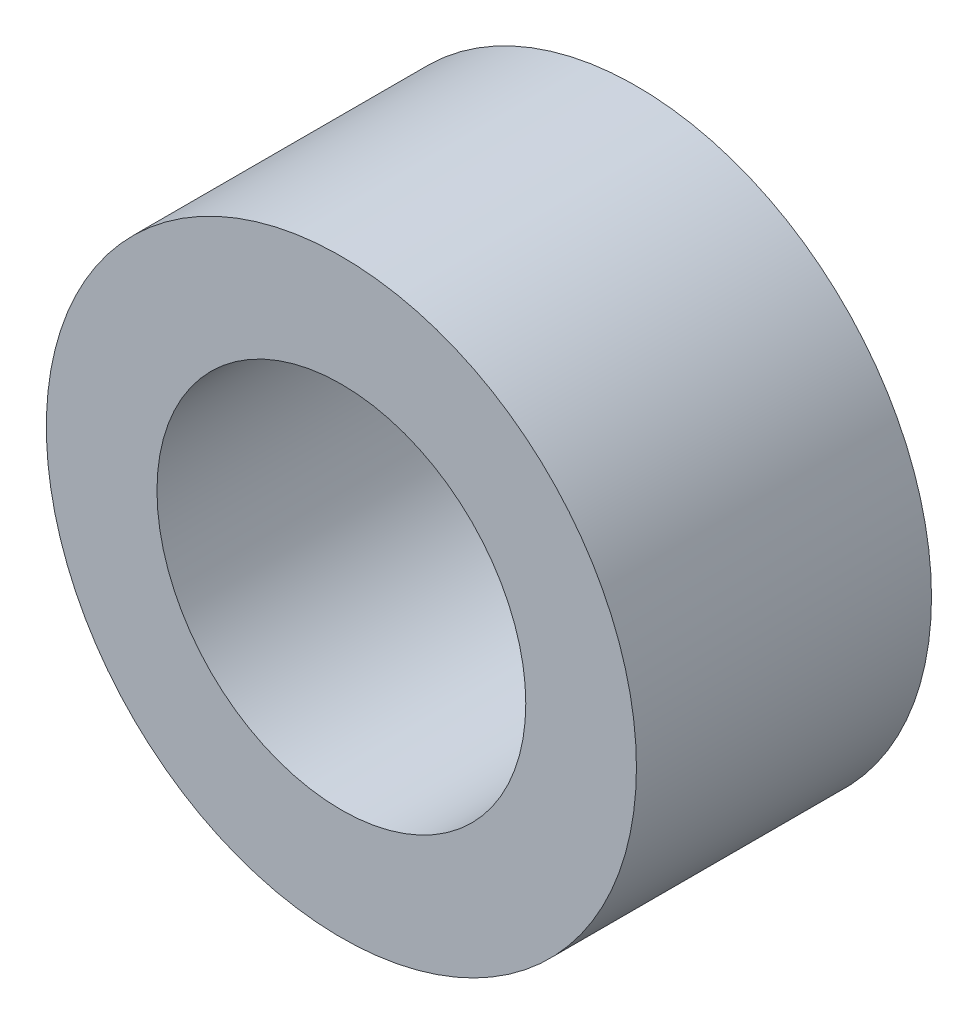
ISO-10303-21;
HEADER;
FILE_DESCRIPTION(('STEP AP214'),'2;1');
FILE_NAME('part.step','',(''),(''),'','','');
FILE_SCHEMA(('AUTOMOTIVE_DESIGN { 1 0 10303 214 1 1 1 1 }'));
ENDSEC;
DATA;
#1=APPLICATION_CONTEXT('core data for automotive mechanical design processes');
#2=APPLICATION_PROTOCOL_DEFINITION('international standard','automotive_design',2000,#1);
#3=PRODUCT_CONTEXT('',#1,'mechanical');
#4=PRODUCT('Part','Part','',(#3));
#5=PRODUCT_RELATED_PRODUCT_CATEGORY('part','',(#4));
#6=PRODUCT_DEFINITION_FORMATION('','',#4);
#7=PRODUCT_DEFINITION_CONTEXT('part definition',#1,'design');
#8=PRODUCT_DEFINITION('design','',#6,#7);
#9=PRODUCT_DEFINITION_SHAPE('','',#8);
#10=(LENGTH_UNIT() NAMED_UNIT(*) SI_UNIT(.MILLI.,.METRE.));
#11=(NAMED_UNIT(*) PLANE_ANGLE_UNIT() SI_UNIT($,.RADIAN.));
#12=(NAMED_UNIT(*) SI_UNIT($,.STERADIAN.) SOLID_ANGLE_UNIT());
#13=UNCERTAINTY_MEASURE_WITH_UNIT(LENGTH_MEASURE(1.E-05),#10,'distance_accuracy_value','');
#14=(GEOMETRIC_REPRESENTATION_CONTEXT(3) GLOBAL_UNCERTAINTY_ASSIGNED_CONTEXT((#13)) GLOBAL_UNIT_ASSIGNED_CONTEXT((#10,
#11,#12)) REPRESENTATION_CONTEXT('',''));
#15=CARTESIAN_POINT('',(0.,0.,0.));
#16=DIRECTION('',(0.,0.,1.));
#17=DIRECTION('',(1.,0.,0.));
#18=AXIS2_PLACEMENT_3D('',#15,#16,#17);
#19=CARTESIAN_POINT('',(0.,0.,5.));
#20=DIRECTION('',(0.,0.,1.));
#21=DIRECTION('',(1.,0.,0.));
#22=AXIS2_PLACEMENT_3D('',#19,#20,#21);
#23=PLANE('',#22);
#24=CARTESIAN_POINT('',(0.,0.,5.));
#25=DIRECTION('',(0.,0.,1.));
#26=DIRECTION('',(1.,0.,0.));
#27=AXIS2_PLACEMENT_3D('',#24,#25,#26);
#28=CIRCLE('',#27,5.);
#29=CARTESIAN_POINT('',(5.,0.,5.));
#30=VERTEX_POINT('',#29);
#31=EDGE_CURVE('E10',#30,#30,#28,.T.);
#32=ORIENTED_EDGE('',*,*,#31,.T.);
#33=EDGE_LOOP('',(#32));
#34=FACE_BOUND('',#33,.T.);
#35=CARTESIAN_POINT('',(0.,0.,5.));
#36=DIRECTION('',(0.,0.,1.));
#37=DIRECTION('',(1.,0.,0.));
#38=AXIS2_PLACEMENT_3D('',#35,#36,#37);
#39=CIRCLE('',#38,3.125);
#40=CARTESIAN_POINT('',(3.125,0.,5.));
#41=VERTEX_POINT('',#40);
#42=EDGE_CURVE('E55',#41,#41,#39,.T.);
#43=ORIENTED_EDGE('',*,*,#42,.F.);
#44=EDGE_LOOP('',(#43));
#45=FACE_BOUND('',#44,.T.);
#46=ADVANCED_FACE('F41',(#34,#45),#23,.T.);
#47=CARTESIAN_POINT('',(0.,0.,0.));
#48=DIRECTION('',(0.,0.,1.));
#49=DIRECTION('',(1.,0.,0.));
#50=AXIS2_PLACEMENT_3D('',#47,#48,#49);
#51=PLANE('',#50);
#52=CARTESIAN_POINT('',(0.,0.,0.));
#53=DIRECTION('',(0.,0.,1.));
#54=DIRECTION('',(1.,0.,0.));
#55=AXIS2_PLACEMENT_3D('',#52,#53,#54);
#56=CIRCLE('',#55,5.);
#57=CARTESIAN_POINT('',(5.,0.,0.));
#58=VERTEX_POINT('',#57);
#59=EDGE_CURVE('E45',#58,#58,#56,.T.);
#60=ORIENTED_EDGE('',*,*,#59,.F.);
#61=EDGE_LOOP('',(#60));
#62=FACE_BOUND('',#61,.T.);
#63=CARTESIAN_POINT('',(0.,0.,0.));
#64=DIRECTION('',(0.,0.,1.));
#65=DIRECTION('',(1.,0.,0.));
#66=AXIS2_PLACEMENT_3D('',#63,#64,#65);
#67=CIRCLE('',#66,3.125);
#68=CARTESIAN_POINT('',(3.125,0.,0.));
#69=VERTEX_POINT('',#68);
#70=EDGE_CURVE('E57',#69,#69,#67,.T.);
#71=ORIENTED_EDGE('',*,*,#70,.T.);
#72=EDGE_LOOP('',(#71));
#73=FACE_BOUND('',#72,.T.);
#74=ADVANCED_FACE('F68',(#62,#73),#51,.F.);
#75=CARTESIAN_POINT('',(0.,0.,5.));
#76=DIRECTION('',(0.,0.,-1.));
#77=DIRECTION('',(-1.,0.,0.));
#78=AXIS2_PLACEMENT_3D('',#75,#76,#77);
#79=CYLINDRICAL_SURFACE('',#78,5.);
#80=ORIENTED_EDGE('',*,*,#31,.F.);
#81=EDGE_LOOP('',(#80));
#82=FACE_BOUND('',#81,.T.);
#83=ORIENTED_EDGE('',*,*,#59,.T.);
#84=EDGE_LOOP('',(#83));
#85=FACE_BOUND('',#84,.T.);
#86=ADVANCED_FACE('F43',(#82,#85),#79,.T.);
#87=CARTESIAN_POINT('',(0.,0.,5.));
#88=DIRECTION('',(0.,0.,-1.));
#89=DIRECTION('',(-1.,0.,0.));
#90=AXIS2_PLACEMENT_3D('',#87,#88,#89);
#91=CYLINDRICAL_SURFACE('',#90,3.125);
#92=ORIENTED_EDGE('',*,*,#42,.T.);
#93=EDGE_LOOP('',(#92));
#94=FACE_BOUND('',#93,.T.);
#95=ORIENTED_EDGE('',*,*,#70,.F.);
#96=EDGE_LOOP('',(#95));
#97=FACE_BOUND('',#96,.T.);
#98=ADVANCED_FACE('F64',(#94,#97),#91,.F.);
#99=CLOSED_SHELL('',(#46,#74,#86,#98));
#100=MANIFOLD_SOLID_BREP('B2',#99);
#101=ADVANCED_BREP_SHAPE_REPRESENTATION('',(#18,#100),#14);
#102=SHAPE_DEFINITION_REPRESENTATION(#9,#101);
ENDSEC;
END-ISO-10303-21;
